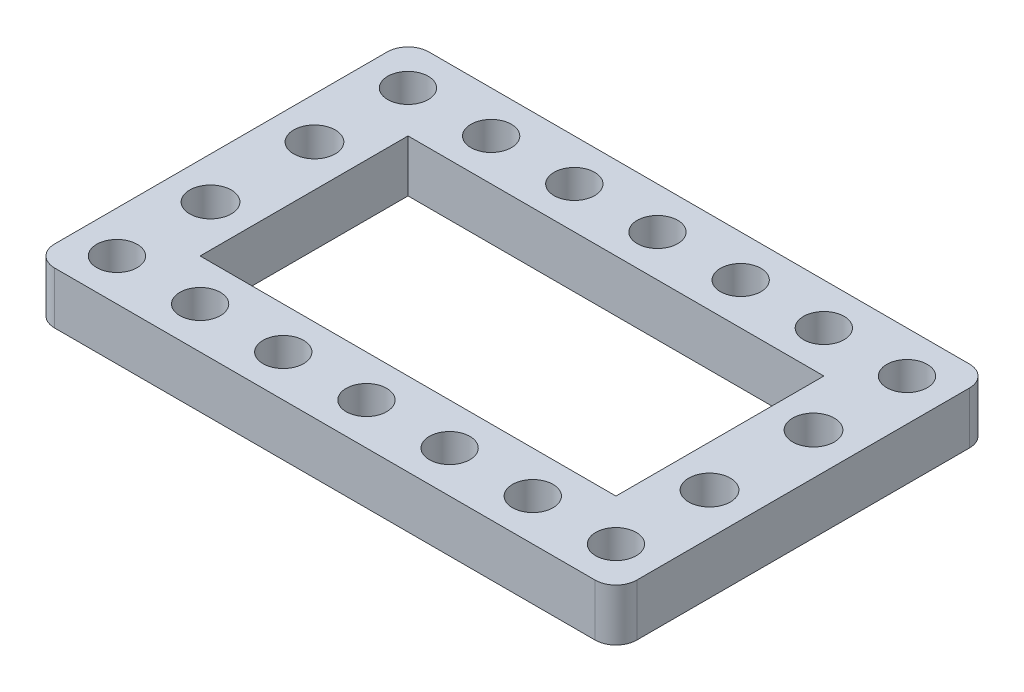
ISO-10303-21;
HEADER;
FILE_DESCRIPTION(('STEP AP214'),'2;1');
FILE_NAME('part.step','',(''),(''),'','','');
FILE_SCHEMA(('AUTOMOTIVE_DESIGN { 1 0 10303 214 1 1 1 1 }'));
ENDSEC;
DATA;
#1=APPLICATION_CONTEXT('core data for automotive mechanical design processes');
#2=APPLICATION_PROTOCOL_DEFINITION('international standard','automotive_design',2000,#1);
#3=PRODUCT_CONTEXT('',#1,'mechanical');
#4=PRODUCT('Part','Part','',(#3));
#5=PRODUCT_RELATED_PRODUCT_CATEGORY('part','',(#4));
#6=PRODUCT_DEFINITION_FORMATION('','',#4);
#7=PRODUCT_DEFINITION_CONTEXT('part definition',#1,'design');
#8=PRODUCT_DEFINITION('design','',#6,#7);
#9=PRODUCT_DEFINITION_SHAPE('','',#8);
#10=(LENGTH_UNIT() NAMED_UNIT(*) SI_UNIT(.MILLI.,.METRE.));
#11=(NAMED_UNIT(*) PLANE_ANGLE_UNIT() SI_UNIT($,.RADIAN.));
#12=(NAMED_UNIT(*) SI_UNIT($,.STERADIAN.) SOLID_ANGLE_UNIT());
#13=UNCERTAINTY_MEASURE_WITH_UNIT(LENGTH_MEASURE(1.E-05),#10,'distance_accuracy_value','');
#14=(GEOMETRIC_REPRESENTATION_CONTEXT(3) GLOBAL_UNCERTAINTY_ASSIGNED_CONTEXT((#13)) GLOBAL_UNIT_ASSIGNED_CONTEXT((#10,
#11,#12)) REPRESENTATION_CONTEXT('',''));
#15=CARTESIAN_POINT('',(0.,0.,0.));
#16=DIRECTION('',(0.,0.,1.));
#17=DIRECTION('',(1.,0.,0.));
#18=AXIS2_PLACEMENT_3D('',#15,#16,#17);
#19=CARTESIAN_POINT('',(76.,5.,2.));
#20=DIRECTION('',(0.,-1.,0.));
#21=DIRECTION('',(0.,0.,-1.));
#22=AXIS2_PLACEMENT_3D('',#19,#20,#21);
#23=CYLINDRICAL_SURFACE('',#22,2.);
#24=DIRECTION('',(0.,-1.,0.));
#25=VECTOR('',#24,1.);
#26=CARTESIAN_POINT('',(76.,5.,0.));
#27=LINE('',#26,#25);
#28=CARTESIAN_POINT('',(76.,5.,0.));
#29=VERTEX_POINT('',#28);
#30=CARTESIAN_POINT('',(76.,0.,0.));
#31=VERTEX_POINT('',#30);
#32=EDGE_CURVE('E291',#29,#31,#27,.T.);
#33=ORIENTED_EDGE('',*,*,#32,.F.);
#34=CARTESIAN_POINT('',(76.,5.,2.));
#35=DIRECTION('',(0.,1.,0.));
#36=DIRECTION('',(0.,0.,1.));
#37=AXIS2_PLACEMENT_3D('',#34,#35,#36);
#38=CIRCLE('',#37,2.);
#39=CARTESIAN_POINT('',(78.,5.,2.));
#40=VERTEX_POINT('',#39);
#41=EDGE_CURVE('E40',#40,#29,#38,.T.);
#42=ORIENTED_EDGE('',*,*,#41,.F.);
#43=DIRECTION('',(0.,-1.,0.));
#44=VECTOR('',#43,1.);
#45=CARTESIAN_POINT('',(78.,-5.,2.));
#46=LINE('',#45,#44);
#47=CARTESIAN_POINT('',(78.,0.,2.));
#48=VERTEX_POINT('',#47);
#49=EDGE_CURVE('E294',#48,#40,#46,.F.);
#50=ORIENTED_EDGE('',*,*,#49,.F.);
#51=CARTESIAN_POINT('',(76.,0.,2.));
#52=DIRECTION('',(0.,1.,0.));
#53=DIRECTION('',(0.,0.,1.));
#54=AXIS2_PLACEMENT_3D('',#51,#52,#53);
#55=CIRCLE('',#54,2.);
#56=EDGE_CURVE('E11',#31,#48,#55,.F.);
#57=ORIENTED_EDGE('',*,*,#56,.F.);
#58=EDGE_LOOP('',(#33,#42,#50,#57));
#59=FACE_BOUND('',#58,.T.);
#60=ADVANCED_FACE('F33',(#59),#23,.T.);
#61=CARTESIAN_POINT('',(76.,-5.,34.));
#62=DIRECTION('',(0.,-1.,0.));
#63=DIRECTION('',(0.,0.,-1.));
#64=AXIS2_PLACEMENT_3D('',#61,#62,#63);
#65=CYLINDRICAL_SURFACE('',#64,2.);
#66=DIRECTION('',(0.,-1.,0.));
#67=VECTOR('',#66,1.);
#68=CARTESIAN_POINT('',(78.,-5.,34.));
#69=LINE('',#68,#67);
#70=CARTESIAN_POINT('',(78.,5.,34.));
#71=VERTEX_POINT('',#70);
#72=CARTESIAN_POINT('',(78.,0.,34.));
#73=VERTEX_POINT('',#72);
#74=EDGE_CURVE('E280',#71,#73,#69,.T.);
#75=ORIENTED_EDGE('',*,*,#74,.F.);
#76=CARTESIAN_POINT('',(76.,5.,34.));
#77=DIRECTION('',(0.,1.,0.));
#78=DIRECTION('',(0.,0.,1.));
#79=AXIS2_PLACEMENT_3D('',#76,#77,#78);
#80=CIRCLE('',#79,2.);
#81=CARTESIAN_POINT('',(76.,5.,36.));
#82=VERTEX_POINT('',#81);
#83=EDGE_CURVE('E286',#82,#71,#80,.T.);
#84=ORIENTED_EDGE('',*,*,#83,.F.);
#85=DIRECTION('',(0.,-1.,0.));
#86=VECTOR('',#85,1.);
#87=CARTESIAN_POINT('',(76.,5.,36.));
#88=LINE('',#87,#86);
#89=CARTESIAN_POINT('',(76.,0.,36.));
#90=VERTEX_POINT('',#89);
#91=EDGE_CURVE('E283',#90,#82,#88,.F.);
#92=ORIENTED_EDGE('',*,*,#91,.F.);
#93=CARTESIAN_POINT('',(76.,0.,34.));
#94=DIRECTION('',(0.,1.,0.));
#95=DIRECTION('',(0.,0.,1.));
#96=AXIS2_PLACEMENT_3D('',#93,#94,#95);
#97=CIRCLE('',#96,2.);
#98=EDGE_CURVE('E289',#73,#90,#97,.F.);
#99=ORIENTED_EDGE('',*,*,#98,.F.);
#100=EDGE_LOOP('',(#75,#84,#92,#99));
#101=FACE_BOUND('',#100,.T.);
#102=ADVANCED_FACE('F351',(#101),#65,.T.);
#103=CARTESIAN_POINT('',(24.,-5.,34.));
#104=DIRECTION('',(0.,1.,0.));
#105=DIRECTION('',(0.,0.,1.));
#106=AXIS2_PLACEMENT_3D('',#103,#104,#105);
#107=CYLINDRICAL_SURFACE('',#106,2.);
#108=DIRECTION('',(0.,1.,0.));
#109=VECTOR('',#108,1.);
#110=CARTESIAN_POINT('',(22.,-5.,34.));
#111=LINE('',#110,#109);
#112=CARTESIAN_POINT('',(22.,0.,34.));
#113=VERTEX_POINT('',#112);
#114=CARTESIAN_POINT('',(22.,5.,34.));
#115=VERTEX_POINT('',#114);
#116=EDGE_CURVE('E270',#113,#115,#111,.T.);
#117=ORIENTED_EDGE('',*,*,#116,.F.);
#118=CARTESIAN_POINT('',(24.,0.,34.));
#119=DIRECTION('',(0.,1.,0.));
#120=DIRECTION('',(0.,0.,1.));
#121=AXIS2_PLACEMENT_3D('',#118,#119,#120);
#122=CIRCLE('',#121,2.);
#123=CARTESIAN_POINT('',(24.,0.,36.));
#124=VERTEX_POINT('',#123);
#125=EDGE_CURVE('E276',#124,#113,#122,.F.);
#126=ORIENTED_EDGE('',*,*,#125,.F.);
#127=DIRECTION('',(0.,1.,0.));
#128=VECTOR('',#127,1.);
#129=CARTESIAN_POINT('',(24.,5.,36.));
#130=LINE('',#129,#128);
#131=CARTESIAN_POINT('',(24.,5.,36.));
#132=VERTEX_POINT('',#131);
#133=EDGE_CURVE('E273',#132,#124,#130,.F.);
#134=ORIENTED_EDGE('',*,*,#133,.F.);
#135=CARTESIAN_POINT('',(24.,5.,34.));
#136=DIRECTION('',(0.,1.,0.));
#137=DIRECTION('',(0.,0.,1.));
#138=AXIS2_PLACEMENT_3D('',#135,#136,#137);
#139=CIRCLE('',#138,2.);
#140=EDGE_CURVE('E278',#115,#132,#139,.T.);
#141=ORIENTED_EDGE('',*,*,#140,.F.);
#142=EDGE_LOOP('',(#117,#126,#134,#141));
#143=FACE_BOUND('',#142,.T.);
#144=ADVANCED_FACE('F355',(#143),#107,.T.);
#145=CARTESIAN_POINT('',(24.,-5.,2.));
#146=DIRECTION('',(0.,-1.,0.));
#147=DIRECTION('',(0.,0.,-1.));
#148=AXIS2_PLACEMENT_3D('',#145,#146,#147);
#149=CYLINDRICAL_SURFACE('',#148,2.);
#150=DIRECTION('',(0.,-1.,0.));
#151=VECTOR('',#150,1.);
#152=CARTESIAN_POINT('',(22.,-5.,2.));
#153=LINE('',#152,#151);
#154=CARTESIAN_POINT('',(22.,5.,2.));
#155=VERTEX_POINT('',#154);
#156=CARTESIAN_POINT('',(22.,0.,1.99999999999999));
#157=VERTEX_POINT('',#156);
#158=EDGE_CURVE('E258',#155,#157,#153,.T.);
#159=ORIENTED_EDGE('',*,*,#158,.F.);
#160=CARTESIAN_POINT('',(24.,5.,2.));
#161=DIRECTION('',(0.,1.,0.));
#162=DIRECTION('',(0.,0.,1.));
#163=AXIS2_PLACEMENT_3D('',#160,#161,#162);
#164=CIRCLE('',#163,2.);
#165=CARTESIAN_POINT('',(24.,5.,0.));
#166=VERTEX_POINT('',#165);
#167=EDGE_CURVE('E264',#166,#155,#164,.T.);
#168=ORIENTED_EDGE('',*,*,#167,.F.);
#169=DIRECTION('',(0.,-1.,0.));
#170=VECTOR('',#169,1.);
#171=CARTESIAN_POINT('',(24.,5.,0.));
#172=LINE('',#171,#170);
#173=CARTESIAN_POINT('',(24.,0.,0.));
#174=VERTEX_POINT('',#173);
#175=EDGE_CURVE('E261',#174,#166,#172,.F.);
#176=ORIENTED_EDGE('',*,*,#175,.F.);
#177=CARTESIAN_POINT('',(24.,0.,2.));
#178=DIRECTION('',(0.,1.,0.));
#179=DIRECTION('',(0.,0.,1.));
#180=AXIS2_PLACEMENT_3D('',#177,#178,#179);
#181=CIRCLE('',#180,2.);
#182=EDGE_CURVE('E267',#157,#174,#181,.F.);
#183=ORIENTED_EDGE('',*,*,#182,.F.);
#184=EDGE_LOOP('',(#159,#168,#176,#183));
#185=FACE_BOUND('',#184,.T.);
#186=ADVANCED_FACE('F307',(#185),#149,.T.);
#187=CARTESIAN_POINT('',(2.00000000000001,5.,0.));
#188=DIRECTION('',(0.,0.,1.));
#189=DIRECTION('',(1.,0.,0.));
#190=AXIS2_PLACEMENT_3D('',#187,#188,#189);
#191=PLANE('',#190);
#192=DIRECTION('',(-1.,0.,0.));
#193=VECTOR('',#192,1.);
#194=CARTESIAN_POINT('',(2.00000000000001,5.,0.));
#195=LINE('',#194,#193);
#196=EDGE_CURVE('E245',#29,#166,#195,.T.);
#197=ORIENTED_EDGE('',*,*,#196,.F.);
#198=ORIENTED_EDGE('',*,*,#32,.T.);
#199=DIRECTION('',(-1.,0.,0.));
#200=VECTOR('',#199,1.);
#201=CARTESIAN_POINT('',(2.00000000000001,0.,0.));
#202=LINE('',#201,#200);
#203=EDGE_CURVE('E236',#31,#174,#202,.T.);
#204=ORIENTED_EDGE('',*,*,#203,.T.);
#205=ORIENTED_EDGE('',*,*,#175,.T.);
#206=EDGE_LOOP('',(#197,#198,#204,#205));
#207=FACE_BOUND('',#206,.T.);
#208=ADVANCED_FACE('F302',(#207),#191,.F.);
#209=CARTESIAN_POINT('',(2.,5.,36.));
#210=DIRECTION('',(0.,0.,-1.));
#211=DIRECTION('',(-1.,0.,0.));
#212=AXIS2_PLACEMENT_3D('',#209,#210,#211);
#213=PLANE('',#212);
#214=DIRECTION('',(1.,0.,0.));
#215=VECTOR('',#214,1.);
#216=CARTESIAN_POINT('',(2.,0.,36.));
#217=LINE('',#216,#215);
#218=EDGE_CURVE('E248',#124,#90,#217,.T.);
#219=ORIENTED_EDGE('',*,*,#218,.T.);
#220=ORIENTED_EDGE('',*,*,#91,.T.);
#221=DIRECTION('',(1.,0.,0.));
#222=VECTOR('',#221,1.);
#223=CARTESIAN_POINT('',(2.,5.,36.));
#224=LINE('',#223,#222);
#225=EDGE_CURVE('E247',#132,#82,#224,.T.);
#226=ORIENTED_EDGE('',*,*,#225,.F.);
#227=ORIENTED_EDGE('',*,*,#133,.T.);
#228=EDGE_LOOP('',(#219,#220,#226,#227));
#229=FACE_BOUND('',#228,.T.);
#230=ADVANCED_FACE('F328',(#229),#213,.F.);
#231=CARTESIAN_POINT('',(98.,5.,34.));
#232=DIRECTION('',(0.,1.,0.));
#233=DIRECTION('',(0.,0.,1.));
#234=AXIS2_PLACEMENT_3D('',#231,#232,#233);
#235=PLANE('',#234);
#236=CARTESIAN_POINT('',(74.,5.,23.));
#237=DIRECTION('',(0.,1.,0.));
#238=DIRECTION('',(0.,0.,1.));
#239=AXIS2_PLACEMENT_3D('',#236,#237,#238);
#240=CIRCLE('',#239,2.);
#241=CARTESIAN_POINT('',(74.,5.,25.));
#242=VERTEX_POINT('',#241);
#243=EDGE_CURVE('E619',#242,#242,#240,.T.);
#244=ORIENTED_EDGE('',*,*,#243,.F.);
#245=EDGE_LOOP('',(#244));
#246=FACE_BOUND('',#245,.T.);
#247=CARTESIAN_POINT('',(26.,5.,13.));
#248=DIRECTION('',(0.,1.,0.));
#249=DIRECTION('',(0.,0.,1.));
#250=AXIS2_PLACEMENT_3D('',#247,#248,#249);
#251=CIRCLE('',#250,2.);
#252=CARTESIAN_POINT('',(26.,5.,15.));
#253=VERTEX_POINT('',#252);
#254=EDGE_CURVE('E624',#253,#253,#251,.T.);
#255=ORIENTED_EDGE('',*,*,#254,.F.);
#256=EDGE_LOOP('',(#255));
#257=FACE_BOUND('',#256,.T.);
#258=CARTESIAN_POINT('',(26.,5.,23.));
#259=DIRECTION('',(0.,1.,0.));
#260=DIRECTION('',(0.,0.,1.));
#261=AXIS2_PLACEMENT_3D('',#258,#259,#260);
#262=CIRCLE('',#261,2.00000000000001);
#263=CARTESIAN_POINT('',(26.,5.,25.));
#264=VERTEX_POINT('',#263);
#265=EDGE_CURVE('E637',#264,#264,#262,.T.);
#266=ORIENTED_EDGE('',*,*,#265,.F.);
#267=EDGE_LOOP('',(#266));
#268=FACE_BOUND('',#267,.T.);
#269=CARTESIAN_POINT('',(74.,5.,13.));
#270=DIRECTION('',(0.,1.,0.));
#271=DIRECTION('',(0.,0.,1.));
#272=AXIS2_PLACEMENT_3D('',#269,#270,#271);
#273=CIRCLE('',#272,2.);
#274=CARTESIAN_POINT('',(74.,5.,15.));
#275=VERTEX_POINT('',#274);
#276=EDGE_CURVE('E316',#275,#275,#273,.T.);
#277=ORIENTED_EDGE('',*,*,#276,.F.);
#278=EDGE_LOOP('',(#277));
#279=FACE_BOUND('',#278,.T.);
#280=DIRECTION('',(0.,0.,1.));
#281=VECTOR('',#280,1.);
#282=CARTESIAN_POINT('',(78.,5.,0.));
#283=LINE('',#282,#281);
#284=EDGE_CURVE('E156',#40,#71,#283,.T.);
#285=ORIENTED_EDGE('',*,*,#284,.F.);
#286=ORIENTED_EDGE('',*,*,#41,.T.);
#287=ORIENTED_EDGE('',*,*,#196,.T.);
#288=ORIENTED_EDGE('',*,*,#167,.T.);
#289=DIRECTION('',(0.,0.,-1.));
#290=VECTOR('',#289,1.);
#291=CARTESIAN_POINT('',(22.,5.,0.));
#292=LINE('',#291,#290);
#293=EDGE_CURVE('E309',#115,#155,#292,.T.);
#294=ORIENTED_EDGE('',*,*,#293,.F.);
#295=ORIENTED_EDGE('',*,*,#140,.T.);
#296=ORIENTED_EDGE('',*,*,#225,.T.);
#297=ORIENTED_EDGE('',*,*,#83,.T.);
#298=EDGE_LOOP('',(#285,#286,#287,#288,#294,#295,#296,#297));
#299=FACE_BOUND('',#298,.T.);
#300=CARTESIAN_POINT('',(74.,5.,4.00475022032541));
#301=DIRECTION('',(0.,1.,0.));
#302=DIRECTION('',(0.,0.,1.));
#303=AXIS2_PLACEMENT_3D('',#300,#301,#302);
#304=CIRCLE('',#303,1.95);
#305=CARTESIAN_POINT('',(74.,5.,5.95475022032541));
#306=VERTEX_POINT('',#305);
#307=EDGE_CURVE('E182',#306,#306,#304,.T.);
#308=ORIENTED_EDGE('',*,*,#307,.F.);
#309=EDGE_LOOP('',(#308));
#310=FACE_BOUND('',#309,.T.);
#311=CARTESIAN_POINT('',(26.,5.,32.));
#312=DIRECTION('',(0.,1.,0.));
#313=DIRECTION('',(0.,0.,1.));
#314=AXIS2_PLACEMENT_3D('',#311,#312,#313);
#315=CIRCLE('',#314,1.95);
#316=CARTESIAN_POINT('',(26.,5.,33.95));
#317=VERTEX_POINT('',#316);
#318=EDGE_CURVE('E183',#317,#317,#315,.T.);
#319=ORIENTED_EDGE('',*,*,#318,.F.);
#320=EDGE_LOOP('',(#319));
#321=FACE_BOUND('',#320,.T.);
#322=CARTESIAN_POINT('',(34.,5.,32.));
#323=DIRECTION('',(0.,1.,0.));
#324=DIRECTION('',(0.,0.,1.));
#325=AXIS2_PLACEMENT_3D('',#322,#323,#324);
#326=CIRCLE('',#325,1.94999999999999);
#327=CARTESIAN_POINT('',(34.,5.,33.95));
#328=VERTEX_POINT('',#327);
#329=EDGE_CURVE('E189',#328,#328,#326,.T.);
#330=ORIENTED_EDGE('',*,*,#329,.F.);
#331=EDGE_LOOP('',(#330));
#332=FACE_BOUND('',#331,.T.);
#333=CARTESIAN_POINT('',(42.,5.,32.));
#334=DIRECTION('',(0.,1.,0.));
#335=DIRECTION('',(0.,0.,1.));
#336=AXIS2_PLACEMENT_3D('',#333,#334,#335);
#337=CIRCLE('',#336,1.95000000000001);
#338=CARTESIAN_POINT('',(42.,5.,33.95));
#339=VERTEX_POINT('',#338);
#340=EDGE_CURVE('E195',#339,#339,#337,.T.);
#341=ORIENTED_EDGE('',*,*,#340,.F.);
#342=EDGE_LOOP('',(#341));
#343=FACE_BOUND('',#342,.T.);
#344=CARTESIAN_POINT('',(50.,5.,32.));
#345=DIRECTION('',(0.,1.,0.));
#346=DIRECTION('',(0.,0.,1.));
#347=AXIS2_PLACEMENT_3D('',#344,#345,#346);
#348=CIRCLE('',#347,1.95);
#349=CARTESIAN_POINT('',(50.,5.,33.95));
#350=VERTEX_POINT('',#349);
#351=EDGE_CURVE('E168',#350,#350,#348,.T.);
#352=ORIENTED_EDGE('',*,*,#351,.F.);
#353=EDGE_LOOP('',(#352));
#354=FACE_BOUND('',#353,.T.);
#355=CARTESIAN_POINT('',(34.,5.,4.00475022032542));
#356=DIRECTION('',(0.,1.,0.));
#357=DIRECTION('',(0.,0.,1.));
#358=AXIS2_PLACEMENT_3D('',#355,#356,#357);
#359=CIRCLE('',#358,1.95);
#360=CARTESIAN_POINT('',(34.,5.,5.95475022032542));
#361=VERTEX_POINT('',#360);
#362=EDGE_CURVE('E212',#361,#361,#359,.T.);
#363=ORIENTED_EDGE('',*,*,#362,.F.);
#364=EDGE_LOOP('',(#363));
#365=FACE_BOUND('',#364,.T.);
#366=CARTESIAN_POINT('',(26.,5.,4.00475022032542));
#367=DIRECTION('',(0.,1.,0.));
#368=DIRECTION('',(0.,0.,1.));
#369=AXIS2_PLACEMENT_3D('',#366,#367,#368);
#370=CIRCLE('',#369,1.95);
#371=CARTESIAN_POINT('',(26.,5.,5.95475022032542));
#372=VERTEX_POINT('',#371);
#373=EDGE_CURVE('E237',#372,#372,#370,.T.);
#374=ORIENTED_EDGE('',*,*,#373,.F.);
#375=EDGE_LOOP('',(#374));
#376=FACE_BOUND('',#375,.T.);
#377=CARTESIAN_POINT('',(42.,5.,4.00475022032542));
#378=DIRECTION('',(0.,1.,0.));
#379=DIRECTION('',(0.,0.,1.));
#380=AXIS2_PLACEMENT_3D('',#377,#378,#379);
#381=CIRCLE('',#380,1.95000000000001);
#382=CARTESIAN_POINT('',(42.,5.,5.95475022032542));
#383=VERTEX_POINT('',#382);
#384=EDGE_CURVE('E213',#383,#383,#381,.T.);
#385=ORIENTED_EDGE('',*,*,#384,.F.);
#386=EDGE_LOOP('',(#385));
#387=FACE_BOUND('',#386,.T.);
#388=CARTESIAN_POINT('',(50.,5.,4.00475022032542));
#389=DIRECTION('',(0.,1.,0.));
#390=DIRECTION('',(0.,0.,1.));
#391=AXIS2_PLACEMENT_3D('',#388,#389,#390);
#392=CIRCLE('',#391,1.95);
#393=CARTESIAN_POINT('',(50.,5.,5.95475022032542));
#394=VERTEX_POINT('',#393);
#395=EDGE_CURVE('E219',#394,#394,#392,.T.);
#396=ORIENTED_EDGE('',*,*,#395,.F.);
#397=EDGE_LOOP('',(#396));
#398=FACE_BOUND('',#397,.T.);
#399=CARTESIAN_POINT('',(58.,5.,4.00475022032542));
#400=DIRECTION('',(0.,1.,0.));
#401=DIRECTION('',(0.,0.,1.));
#402=AXIS2_PLACEMENT_3D('',#399,#400,#401);
#403=CIRCLE('',#402,1.95);
#404=CARTESIAN_POINT('',(58.,5.,5.95475022032541));
#405=VERTEX_POINT('',#404);
#406=EDGE_CURVE('E225',#405,#405,#403,.T.);
#407=ORIENTED_EDGE('',*,*,#406,.F.);
#408=EDGE_LOOP('',(#407));
#409=FACE_BOUND('',#408,.T.);
#410=CARTESIAN_POINT('',(66.,5.,4.00475022032541));
#411=DIRECTION('',(0.,1.,0.));
#412=DIRECTION('',(0.,0.,1.));
#413=AXIS2_PLACEMENT_3D('',#410,#411,#412);
#414=CIRCLE('',#413,1.95);
#415=CARTESIAN_POINT('',(66.,5.,5.95475022032541));
#416=VERTEX_POINT('',#415);
#417=EDGE_CURVE('E206',#416,#416,#414,.T.);
#418=ORIENTED_EDGE('',*,*,#417,.F.);
#419=EDGE_LOOP('',(#418));
#420=FACE_BOUND('',#419,.T.);
#421=DIRECTION('',(0.,0.,1.));
#422=VECTOR('',#421,1.);
#423=CARTESIAN_POINT('',(30.,5.,8.00000000000001));
#424=LINE('',#423,#422);
#425=CARTESIAN_POINT('',(30.,5.,8.00000000000001));
#426=VERTEX_POINT('',#425);
#427=CARTESIAN_POINT('',(30.,5.,28.));
#428=VERTEX_POINT('',#427);
#429=EDGE_CURVE('E125',#426,#428,#424,.T.);
#430=ORIENTED_EDGE('',*,*,#429,.F.);
#431=DIRECTION('',(-1.,0.,0.));
#432=VECTOR('',#431,1.);
#433=CARTESIAN_POINT('',(30.,5.,8.00000000000001));
#434=LINE('',#433,#432);
#435=CARTESIAN_POINT('',(70.,5.,8.));
#436=VERTEX_POINT('',#435);
#437=EDGE_CURVE('E143',#436,#426,#434,.T.);
#438=ORIENTED_EDGE('',*,*,#437,.F.);
#439=DIRECTION('',(0.,0.,-1.));
#440=VECTOR('',#439,1.);
#441=CARTESIAN_POINT('',(70.,5.,8.));
#442=LINE('',#441,#440);
#443=CARTESIAN_POINT('',(70.,5.,28.));
#444=VERTEX_POINT('',#443);
#445=EDGE_CURVE('E146',#444,#436,#442,.T.);
#446=ORIENTED_EDGE('',*,*,#445,.F.);
#447=DIRECTION('',(1.,0.,0.));
#448=VECTOR('',#447,1.);
#449=CARTESIAN_POINT('',(30.,5.,28.));
#450=LINE('',#449,#448);
#451=EDGE_CURVE('E155',#428,#444,#450,.T.);
#452=ORIENTED_EDGE('',*,*,#451,.F.);
#453=EDGE_LOOP('',(#430,#438,#446,#452));
#454=FACE_BOUND('',#453,.T.);
#455=CARTESIAN_POINT('',(74.,5.,32.));
#456=DIRECTION('',(0.,1.,0.));
#457=DIRECTION('',(0.,0.,1.));
#458=AXIS2_PLACEMENT_3D('',#455,#456,#457);
#459=CIRCLE('',#458,1.95);
#460=CARTESIAN_POINT('',(74.,5.,33.95));
#461=VERTEX_POINT('',#460);
#462=EDGE_CURVE('E149',#461,#461,#459,.T.);
#463=ORIENTED_EDGE('',*,*,#462,.F.);
#464=EDGE_LOOP('',(#463));
#465=FACE_BOUND('',#464,.T.);
#466=CARTESIAN_POINT('',(66.,5.,32.));
#467=DIRECTION('',(0.,1.,0.));
#468=DIRECTION('',(0.,0.,1.));
#469=AXIS2_PLACEMENT_3D('',#466,#467,#468);
#470=CIRCLE('',#469,1.95);
#471=CARTESIAN_POINT('',(66.,5.,33.95));
#472=VERTEX_POINT('',#471);
#473=EDGE_CURVE('E175',#472,#472,#470,.T.);
#474=ORIENTED_EDGE('',*,*,#473,.F.);
#475=EDGE_LOOP('',(#474));
#476=FACE_BOUND('',#475,.T.);
#477=CARTESIAN_POINT('',(58.,5.,32.));
#478=DIRECTION('',(0.,1.,0.));
#479=DIRECTION('',(0.,0.,1.));
#480=AXIS2_PLACEMENT_3D('',#477,#478,#479);
#481=CIRCLE('',#480,1.95);
#482=CARTESIAN_POINT('',(58.,5.,33.95));
#483=VERTEX_POINT('',#482);
#484=EDGE_CURVE('E169',#483,#483,#481,.T.);
#485=ORIENTED_EDGE('',*,*,#484,.F.);
#486=EDGE_LOOP('',(#485));
#487=FACE_BOUND('',#486,.T.);
#488=ADVANCED_FACE('F297',(#246,#257,#268,#279,#299,#310,#321,#332,#343,#354,#365,#376,#387,
#398,#409,#420,#454,#465,#476,#487),#235,.T.);
#489=CARTESIAN_POINT('',(98.,0.,34.));
#490=DIRECTION('',(0.,1.,0.));
#491=DIRECTION('',(0.,0.,1.));
#492=AXIS2_PLACEMENT_3D('',#489,#490,#491);
#493=PLANE('',#492);
#494=CARTESIAN_POINT('',(74.,0.,23.));
#495=DIRECTION('',(0.,1.,0.));
#496=DIRECTION('',(0.,0.,1.));
#497=AXIS2_PLACEMENT_3D('',#494,#495,#496);
#498=CIRCLE('',#497,2.);
#499=CARTESIAN_POINT('',(74.,0.,25.));
#500=VERTEX_POINT('',#499);
#501=EDGE_CURVE('E616',#500,#500,#498,.T.);
#502=ORIENTED_EDGE('',*,*,#501,.T.);
#503=EDGE_LOOP('',(#502));
#504=FACE_BOUND('',#503,.T.);
#505=CARTESIAN_POINT('',(26.,0.,13.));
#506=DIRECTION('',(0.,1.,0.));
#507=DIRECTION('',(0.,0.,1.));
#508=AXIS2_PLACEMENT_3D('',#505,#506,#507);
#509=CIRCLE('',#508,2.);
#510=CARTESIAN_POINT('',(26.,0.,15.));
#511=VERTEX_POINT('',#510);
#512=EDGE_CURVE('E620',#511,#511,#509,.T.);
#513=ORIENTED_EDGE('',*,*,#512,.T.);
#514=EDGE_LOOP('',(#513));
#515=FACE_BOUND('',#514,.T.);
#516=CARTESIAN_POINT('',(26.,0.,23.));
#517=DIRECTION('',(0.,1.,0.));
#518=DIRECTION('',(0.,0.,1.));
#519=AXIS2_PLACEMENT_3D('',#516,#517,#518);
#520=CIRCLE('',#519,2.00000000000001);
#521=CARTESIAN_POINT('',(26.,0.,25.));
#522=VERTEX_POINT('',#521);
#523=EDGE_CURVE('E629',#522,#522,#520,.T.);
#524=ORIENTED_EDGE('',*,*,#523,.T.);
#525=EDGE_LOOP('',(#524));
#526=FACE_BOUND('',#525,.T.);
#527=CARTESIAN_POINT('',(74.,0.,13.));
#528=DIRECTION('',(0.,1.,0.));
#529=DIRECTION('',(0.,0.,1.));
#530=AXIS2_PLACEMENT_3D('',#527,#528,#529);
#531=CIRCLE('',#530,2.);
#532=CARTESIAN_POINT('',(74.,0.,15.));
#533=VERTEX_POINT('',#532);
#534=EDGE_CURVE('E312',#533,#533,#531,.T.);
#535=ORIENTED_EDGE('',*,*,#534,.T.);
#536=EDGE_LOOP('',(#535));
#537=FACE_BOUND('',#536,.T.);
#538=CARTESIAN_POINT('',(74.,0.,4.00475022032541));
#539=DIRECTION('',(0.,1.,0.));
#540=DIRECTION('',(0.,0.,1.));
#541=AXIS2_PLACEMENT_3D('',#538,#539,#540);
#542=CIRCLE('',#541,1.95);
#543=CARTESIAN_POINT('',(74.,0.,5.95475022032541));
#544=VERTEX_POINT('',#543);
#545=EDGE_CURVE('E203',#544,#544,#542,.T.);
#546=ORIENTED_EDGE('',*,*,#545,.T.);
#547=EDGE_LOOP('',(#546));
#548=FACE_BOUND('',#547,.T.);
#549=CARTESIAN_POINT('',(26.,0.,32.));
#550=DIRECTION('',(0.,1.,0.));
#551=DIRECTION('',(0.,0.,1.));
#552=AXIS2_PLACEMENT_3D('',#549,#550,#551);
#553=CIRCLE('',#552,1.95);
#554=CARTESIAN_POINT('',(26.,0.,33.95));
#555=VERTEX_POINT('',#554);
#556=EDGE_CURVE('E179',#555,#555,#553,.T.);
#557=ORIENTED_EDGE('',*,*,#556,.T.);
#558=EDGE_LOOP('',(#557));
#559=FACE_BOUND('',#558,.T.);
#560=CARTESIAN_POINT('',(34.,0.,32.));
#561=DIRECTION('',(0.,1.,0.));
#562=DIRECTION('',(0.,0.,1.));
#563=AXIS2_PLACEMENT_3D('',#560,#561,#562);
#564=CIRCLE('',#563,1.94999999999999);
#565=CARTESIAN_POINT('',(34.,0.,33.95));
#566=VERTEX_POINT('',#565);
#567=EDGE_CURVE('E186',#566,#566,#564,.T.);
#568=ORIENTED_EDGE('',*,*,#567,.T.);
#569=EDGE_LOOP('',(#568));
#570=FACE_BOUND('',#569,.T.);
#571=CARTESIAN_POINT('',(42.,0.,32.));
#572=DIRECTION('',(0.,1.,0.));
#573=DIRECTION('',(0.,0.,1.));
#574=AXIS2_PLACEMENT_3D('',#571,#572,#573);
#575=CIRCLE('',#574,1.95000000000001);
#576=CARTESIAN_POINT('',(42.,0.,33.95));
#577=VERTEX_POINT('',#576);
#578=EDGE_CURVE('E192',#577,#577,#575,.T.);
#579=ORIENTED_EDGE('',*,*,#578,.T.);
#580=EDGE_LOOP('',(#579));
#581=FACE_BOUND('',#580,.T.);
#582=CARTESIAN_POINT('',(50.,0.,32.));
#583=DIRECTION('',(0.,1.,0.));
#584=DIRECTION('',(0.,0.,1.));
#585=AXIS2_PLACEMENT_3D('',#582,#583,#584);
#586=CIRCLE('',#585,1.95);
#587=CARTESIAN_POINT('',(50.,0.,33.95));
#588=VERTEX_POINT('',#587);
#589=EDGE_CURVE('E198',#588,#588,#586,.T.);
#590=ORIENTED_EDGE('',*,*,#589,.T.);
#591=EDGE_LOOP('',(#590));
#592=FACE_BOUND('',#591,.T.);
#593=CARTESIAN_POINT('',(34.,0.,4.00475022032542));
#594=DIRECTION('',(0.,1.,0.));
#595=DIRECTION('',(0.,0.,1.));
#596=AXIS2_PLACEMENT_3D('',#593,#594,#595);
#597=CIRCLE('',#596,1.95);
#598=CARTESIAN_POINT('',(34.,0.,5.95475022032542));
#599=VERTEX_POINT('',#598);
#600=EDGE_CURVE('E240',#599,#599,#597,.T.);
#601=ORIENTED_EDGE('',*,*,#600,.T.);
#602=EDGE_LOOP('',(#601));
#603=FACE_BOUND('',#602,.T.);
#604=CARTESIAN_POINT('',(26.,0.,4.00475022032542));
#605=DIRECTION('',(0.,1.,0.));
#606=DIRECTION('',(0.,0.,1.));
#607=AXIS2_PLACEMENT_3D('',#604,#605,#606);
#608=CIRCLE('',#607,1.95);
#609=CARTESIAN_POINT('',(26.,0.,5.95475022032542));
#610=VERTEX_POINT('',#609);
#611=EDGE_CURVE('E233',#610,#610,#608,.T.);
#612=ORIENTED_EDGE('',*,*,#611,.T.);
#613=EDGE_LOOP('',(#612));
#614=FACE_BOUND('',#613,.T.);
#615=CARTESIAN_POINT('',(42.,0.,4.00475022032542));
#616=DIRECTION('',(0.,1.,0.));
#617=DIRECTION('',(0.,0.,1.));
#618=AXIS2_PLACEMENT_3D('',#615,#616,#617);
#619=CIRCLE('',#618,1.95000000000001);
#620=CARTESIAN_POINT('',(42.,0.,5.95475022032542));
#621=VERTEX_POINT('',#620);
#622=EDGE_CURVE('E209',#621,#621,#619,.T.);
#623=ORIENTED_EDGE('',*,*,#622,.T.);
#624=EDGE_LOOP('',(#623));
#625=FACE_BOUND('',#624,.T.);
#626=CARTESIAN_POINT('',(50.,0.,4.00475022032542));
#627=DIRECTION('',(0.,1.,0.));
#628=DIRECTION('',(0.,0.,1.));
#629=AXIS2_PLACEMENT_3D('',#626,#627,#628);
#630=CIRCLE('',#629,1.95);
#631=CARTESIAN_POINT('',(50.,0.,5.95475022032542));
#632=VERTEX_POINT('',#631);
#633=EDGE_CURVE('E216',#632,#632,#630,.T.);
#634=ORIENTED_EDGE('',*,*,#633,.T.);
#635=EDGE_LOOP('',(#634));
#636=FACE_BOUND('',#635,.T.);
#637=CARTESIAN_POINT('',(58.,0.,4.00475022032542));
#638=DIRECTION('',(0.,1.,0.));
#639=DIRECTION('',(0.,0.,1.));
#640=AXIS2_PLACEMENT_3D('',#637,#638,#639);
#641=CIRCLE('',#640,1.95);
#642=CARTESIAN_POINT('',(58.,0.,5.95475022032541));
#643=VERTEX_POINT('',#642);
#644=EDGE_CURVE('E222',#643,#643,#641,.T.);
#645=ORIENTED_EDGE('',*,*,#644,.T.);
#646=EDGE_LOOP('',(#645));
#647=FACE_BOUND('',#646,.T.);
#648=CARTESIAN_POINT('',(66.,0.,4.00475022032541));
#649=DIRECTION('',(0.,1.,0.));
#650=DIRECTION('',(0.,0.,1.));
#651=AXIS2_PLACEMENT_3D('',#648,#649,#650);
#652=CIRCLE('',#651,1.95);
#653=CARTESIAN_POINT('',(66.,0.,5.95475022032541));
#654=VERTEX_POINT('',#653);
#655=EDGE_CURVE('E228',#654,#654,#652,.T.);
#656=ORIENTED_EDGE('',*,*,#655,.T.);
#657=EDGE_LOOP('',(#656));
#658=FACE_BOUND('',#657,.T.);
#659=DIRECTION('',(-1.,0.,0.));
#660=VECTOR('',#659,1.);
#661=CARTESIAN_POINT('',(30.,0.,8.00000000000001));
#662=LINE('',#661,#660);
#663=CARTESIAN_POINT('',(70.,0.,8.));
#664=VERTEX_POINT('',#663);
#665=CARTESIAN_POINT('',(30.,0.,8.00000000000001));
#666=VERTEX_POINT('',#665);
#667=EDGE_CURVE('E130',#664,#666,#662,.T.);
#668=ORIENTED_EDGE('',*,*,#667,.T.);
#669=DIRECTION('',(0.,0.,1.));
#670=VECTOR('',#669,1.);
#671=CARTESIAN_POINT('',(30.,0.,8.00000000000001));
#672=LINE('',#671,#670);
#673=CARTESIAN_POINT('',(30.,0.,28.));
#674=VERTEX_POINT('',#673);
#675=EDGE_CURVE('E122',#666,#674,#672,.T.);
#676=ORIENTED_EDGE('',*,*,#675,.T.);
#677=DIRECTION('',(1.,0.,0.));
#678=VECTOR('',#677,1.);
#679=CARTESIAN_POINT('',(30.,0.,28.));
#680=LINE('',#679,#678);
#681=CARTESIAN_POINT('',(70.,0.,28.));
#682=VERTEX_POINT('',#681);
#683=EDGE_CURVE('E134',#674,#682,#680,.T.);
#684=ORIENTED_EDGE('',*,*,#683,.T.);
#685=DIRECTION('',(0.,0.,-1.));
#686=VECTOR('',#685,1.);
#687=CARTESIAN_POINT('',(70.,0.,8.));
#688=LINE('',#687,#686);
#689=EDGE_CURVE('E138',#682,#664,#688,.T.);
#690=ORIENTED_EDGE('',*,*,#689,.T.);
#691=EDGE_LOOP('',(#668,#676,#684,#690));
#692=FACE_BOUND('',#691,.T.);
#693=CARTESIAN_POINT('',(74.,0.,32.));
#694=DIRECTION('',(0.,1.,0.));
#695=DIRECTION('',(0.,0.,1.));
#696=AXIS2_PLACEMENT_3D('',#693,#694,#695);
#697=CIRCLE('',#696,1.95);
#698=CARTESIAN_POINT('',(74.,0.,33.95));
#699=VERTEX_POINT('',#698);
#700=EDGE_CURVE('E178',#699,#699,#697,.T.);
#701=ORIENTED_EDGE('',*,*,#700,.T.);
#702=EDGE_LOOP('',(#701));
#703=FACE_BOUND('',#702,.T.);
#704=CARTESIAN_POINT('',(66.,0.,32.));
#705=DIRECTION('',(0.,1.,0.));
#706=DIRECTION('',(0.,0.,1.));
#707=AXIS2_PLACEMENT_3D('',#704,#705,#706);
#708=CIRCLE('',#707,1.95);
#709=CARTESIAN_POINT('',(66.,0.,33.95));
#710=VERTEX_POINT('',#709);
#711=EDGE_CURVE('E172',#710,#710,#708,.T.);
#712=ORIENTED_EDGE('',*,*,#711,.T.);
#713=EDGE_LOOP('',(#712));
#714=FACE_BOUND('',#713,.T.);
#715=CARTESIAN_POINT('',(58.,0.,32.));
#716=DIRECTION('',(0.,1.,0.));
#717=DIRECTION('',(0.,0.,1.));
#718=AXIS2_PLACEMENT_3D('',#715,#716,#717);
#719=CIRCLE('',#718,1.95);
#720=CARTESIAN_POINT('',(58.,0.,33.95));
#721=VERTEX_POINT('',#720);
#722=EDGE_CURVE('E165',#721,#721,#719,.T.);
#723=ORIENTED_EDGE('',*,*,#722,.T.);
#724=EDGE_LOOP('',(#723));
#725=FACE_BOUND('',#724,.T.);
#726=ORIENTED_EDGE('',*,*,#203,.F.);
#727=ORIENTED_EDGE('',*,*,#56,.T.);
#728=DIRECTION('',(0.,0.,1.));
#729=VECTOR('',#728,1.);
#730=CARTESIAN_POINT('',(78.,0.,34.));
#731=LINE('',#730,#729);
#732=EDGE_CURVE('E256',#48,#73,#731,.T.);
#733=ORIENTED_EDGE('',*,*,#732,.T.);
#734=ORIENTED_EDGE('',*,*,#98,.T.);
#735=ORIENTED_EDGE('',*,*,#218,.F.);
#736=ORIENTED_EDGE('',*,*,#125,.T.);
#737=DIRECTION('',(0.,0.,-1.));
#738=VECTOR('',#737,1.);
#739=CARTESIAN_POINT('',(22.,0.,34.));
#740=LINE('',#739,#738);
#741=EDGE_CURVE('E251',#113,#157,#740,.T.);
#742=ORIENTED_EDGE('',*,*,#741,.T.);
#743=ORIENTED_EDGE('',*,*,#182,.T.);
#744=EDGE_LOOP('',(#726,#727,#733,#734,#735,#736,#742,#743));
#745=FACE_BOUND('',#744,.T.);
#746=ADVANCED_FACE('F140',(#504,#515,#526,#537,#548,#559,#570,#581,#592,#603,#614,#625,#636,
#647,#658,#692,#703,#714,#725,#745),#493,.F.);
#747=CARTESIAN_POINT('',(58.,0.,32.));
#748=DIRECTION('',(0.,1.,0.));
#749=DIRECTION('',(0.,0.,1.));
#750=AXIS2_PLACEMENT_3D('',#747,#748,#749);
#751=CYLINDRICAL_SURFACE('',#750,1.95);
#752=ORIENTED_EDGE('',*,*,#722,.F.);
#753=EDGE_LOOP('',(#752));
#754=FACE_BOUND('',#753,.T.);
#755=ORIENTED_EDGE('',*,*,#484,.T.);
#756=EDGE_LOOP('',(#755));
#757=FACE_BOUND('',#756,.T.);
#758=ADVANCED_FACE('F335',(#754,#757),#751,.F.);
#759=CARTESIAN_POINT('',(66.,0.,32.));
#760=DIRECTION('',(0.,1.,0.));
#761=DIRECTION('',(0.,0.,1.));
#762=AXIS2_PLACEMENT_3D('',#759,#760,#761);
#763=CYLINDRICAL_SURFACE('',#762,1.95);
#764=ORIENTED_EDGE('',*,*,#711,.F.);
#765=EDGE_LOOP('',(#764));
#766=FACE_BOUND('',#765,.T.);
#767=ORIENTED_EDGE('',*,*,#473,.T.);
#768=EDGE_LOOP('',(#767));
#769=FACE_BOUND('',#768,.T.);
#770=ADVANCED_FACE('F337',(#766,#769),#763,.F.);
#771=CARTESIAN_POINT('',(74.,0.,32.));
#772=DIRECTION('',(0.,1.,0.));
#773=DIRECTION('',(0.,0.,1.));
#774=AXIS2_PLACEMENT_3D('',#771,#772,#773);
#775=CYLINDRICAL_SURFACE('',#774,1.95);
#776=ORIENTED_EDGE('',*,*,#700,.F.);
#777=EDGE_LOOP('',(#776));
#778=FACE_BOUND('',#777,.T.);
#779=ORIENTED_EDGE('',*,*,#462,.T.);
#780=EDGE_LOOP('',(#779));
#781=FACE_BOUND('',#780,.T.);
#782=ADVANCED_FACE('F324',(#778,#781),#775,.F.);
#783=CARTESIAN_POINT('',(30.,0.,8.00000000000001));
#784=DIRECTION('',(-1.,0.,0.));
#785=DIRECTION('',(0.,0.,1.));
#786=AXIS2_PLACEMENT_3D('',#783,#784,#785);
#787=PLANE('',#786);
#788=ORIENTED_EDGE('',*,*,#429,.T.);
#789=DIRECTION('',(0.,1.,0.));
#790=VECTOR('',#789,1.);
#791=CARTESIAN_POINT('',(30.,0.,28.));
#792=LINE('',#791,#790);
#793=EDGE_CURVE('E118',#674,#428,#792,.T.);
#794=ORIENTED_EDGE('',*,*,#793,.F.);
#795=ORIENTED_EDGE('',*,*,#675,.F.);
#796=DIRECTION('',(0.,1.,0.));
#797=VECTOR('',#796,1.);
#798=CARTESIAN_POINT('',(30.,0.,8.00000000000001));
#799=LINE('',#798,#797);
#800=EDGE_CURVE('E160',#666,#426,#799,.T.);
#801=ORIENTED_EDGE('',*,*,#800,.T.);
#802=EDGE_LOOP('',(#788,#794,#795,#801));
#803=FACE_BOUND('',#802,.T.);
#804=ADVANCED_FACE('F120',(#803),#787,.F.);
#805=CARTESIAN_POINT('',(30.,0.,8.00000000000001));
#806=DIRECTION('',(0.,0.,-1.));
#807=DIRECTION('',(-1.,0.,0.));
#808=AXIS2_PLACEMENT_3D('',#805,#806,#807);
#809=PLANE('',#808);
#810=ORIENTED_EDGE('',*,*,#437,.T.);
#811=ORIENTED_EDGE('',*,*,#800,.F.);
#812=ORIENTED_EDGE('',*,*,#667,.F.);
#813=DIRECTION('',(0.,1.,0.));
#814=VECTOR('',#813,1.);
#815=CARTESIAN_POINT('',(70.,0.,8.));
#816=LINE('',#815,#814);
#817=EDGE_CURVE('E162',#664,#436,#816,.T.);
#818=ORIENTED_EDGE('',*,*,#817,.T.);
#819=EDGE_LOOP('',(#810,#811,#812,#818));
#820=FACE_BOUND('',#819,.T.);
#821=ADVANCED_FACE('F445',(#820),#809,.F.);
#822=CARTESIAN_POINT('',(70.,0.,8.));
#823=DIRECTION('',(1.,0.,0.));
#824=DIRECTION('',(0.,0.,-1.));
#825=AXIS2_PLACEMENT_3D('',#822,#823,#824);
#826=PLANE('',#825);
#827=ORIENTED_EDGE('',*,*,#445,.T.);
#828=ORIENTED_EDGE('',*,*,#817,.F.);
#829=ORIENTED_EDGE('',*,*,#689,.F.);
#830=DIRECTION('',(0.,1.,0.));
#831=VECTOR('',#830,1.);
#832=CARTESIAN_POINT('',(70.,0.,28.));
#833=LINE('',#832,#831);
#834=EDGE_CURVE('E129',#682,#444,#833,.T.);
#835=ORIENTED_EDGE('',*,*,#834,.T.);
#836=EDGE_LOOP('',(#827,#828,#829,#835));
#837=FACE_BOUND('',#836,.T.);
#838=ADVANCED_FACE('F443',(#837),#826,.F.);
#839=CARTESIAN_POINT('',(30.,0.,28.));
#840=DIRECTION('',(0.,0.,1.));
#841=DIRECTION('',(1.,0.,0.));
#842=AXIS2_PLACEMENT_3D('',#839,#840,#841);
#843=PLANE('',#842);
#844=ORIENTED_EDGE('',*,*,#451,.T.);
#845=ORIENTED_EDGE('',*,*,#834,.F.);
#846=ORIENTED_EDGE('',*,*,#683,.F.);
#847=ORIENTED_EDGE('',*,*,#793,.T.);
#848=EDGE_LOOP('',(#844,#845,#846,#847));
#849=FACE_BOUND('',#848,.T.);
#850=ADVANCED_FACE('F135',(#849),#843,.F.);
#851=CARTESIAN_POINT('',(66.,0.,4.00475022032541));
#852=DIRECTION('',(0.,1.,0.));
#853=DIRECTION('',(0.,0.,1.));
#854=AXIS2_PLACEMENT_3D('',#851,#852,#853);
#855=CYLINDRICAL_SURFACE('',#854,1.95);
#856=ORIENTED_EDGE('',*,*,#655,.F.);
#857=EDGE_LOOP('',(#856));
#858=FACE_BOUND('',#857,.T.);
#859=ORIENTED_EDGE('',*,*,#417,.T.);
#860=EDGE_LOOP('',(#859));
#861=FACE_BOUND('',#860,.T.);
#862=ADVANCED_FACE('F381',(#858,#861),#855,.F.);
#863=CARTESIAN_POINT('',(58.,0.,4.00475022032542));
#864=DIRECTION('',(0.,1.,0.));
#865=DIRECTION('',(0.,0.,1.));
#866=AXIS2_PLACEMENT_3D('',#863,#864,#865);
#867=CYLINDRICAL_SURFACE('',#866,1.95);
#868=ORIENTED_EDGE('',*,*,#644,.F.);
#869=EDGE_LOOP('',(#868));
#870=FACE_BOUND('',#869,.T.);
#871=ORIENTED_EDGE('',*,*,#406,.T.);
#872=EDGE_LOOP('',(#871));
#873=FACE_BOUND('',#872,.T.);
#874=ADVANCED_FACE('F384',(#870,#873),#867,.F.);
#875=CARTESIAN_POINT('',(50.,0.,4.00475022032542));
#876=DIRECTION('',(0.,1.,0.));
#877=DIRECTION('',(0.,0.,1.));
#878=AXIS2_PLACEMENT_3D('',#875,#876,#877);
#879=CYLINDRICAL_SURFACE('',#878,1.95);
#880=ORIENTED_EDGE('',*,*,#633,.F.);
#881=EDGE_LOOP('',(#880));
#882=FACE_BOUND('',#881,.T.);
#883=ORIENTED_EDGE('',*,*,#395,.T.);
#884=EDGE_LOOP('',(#883));
#885=FACE_BOUND('',#884,.T.);
#886=ADVANCED_FACE('F388',(#882,#885),#879,.F.);
#887=CARTESIAN_POINT('',(42.,0.,4.00475022032542));
#888=DIRECTION('',(0.,1.,0.));
#889=DIRECTION('',(0.,0.,1.));
#890=AXIS2_PLACEMENT_3D('',#887,#888,#889);
#891=CYLINDRICAL_SURFACE('',#890,1.95000000000001);
#892=ORIENTED_EDGE('',*,*,#622,.F.);
#893=EDGE_LOOP('',(#892));
#894=FACE_BOUND('',#893,.T.);
#895=ORIENTED_EDGE('',*,*,#384,.T.);
#896=EDGE_LOOP('',(#895));
#897=FACE_BOUND('',#896,.T.);
#898=ADVANCED_FACE('F379',(#894,#897),#891,.F.);
#899=CARTESIAN_POINT('',(26.,0.,4.00475022032542));
#900=DIRECTION('',(0.,1.,0.));
#901=DIRECTION('',(0.,0.,1.));
#902=AXIS2_PLACEMENT_3D('',#899,#900,#901);
#903=CYLINDRICAL_SURFACE('',#902,1.95);
#904=ORIENTED_EDGE('',*,*,#611,.F.);
#905=EDGE_LOOP('',(#904));
#906=FACE_BOUND('',#905,.T.);
#907=ORIENTED_EDGE('',*,*,#373,.T.);
#908=EDGE_LOOP('',(#907));
#909=FACE_BOUND('',#908,.T.);
#910=ADVANCED_FACE('F375',(#906,#909),#903,.F.);
#911=CARTESIAN_POINT('',(34.,0.,4.00475022032542));
#912=DIRECTION('',(0.,1.,0.));
#913=DIRECTION('',(0.,0.,1.));
#914=AXIS2_PLACEMENT_3D('',#911,#912,#913);
#915=CYLINDRICAL_SURFACE('',#914,1.95);
#916=ORIENTED_EDGE('',*,*,#600,.F.);
#917=EDGE_LOOP('',(#916));
#918=FACE_BOUND('',#917,.T.);
#919=ORIENTED_EDGE('',*,*,#362,.T.);
#920=EDGE_LOOP('',(#919));
#921=FACE_BOUND('',#920,.T.);
#922=ADVANCED_FACE('F371',(#918,#921),#915,.F.);
#923=CARTESIAN_POINT('',(50.,0.,32.));
#924=DIRECTION('',(0.,1.,0.));
#925=DIRECTION('',(0.,0.,1.));
#926=AXIS2_PLACEMENT_3D('',#923,#924,#925);
#927=CYLINDRICAL_SURFACE('',#926,1.95);
#928=ORIENTED_EDGE('',*,*,#589,.F.);
#929=EDGE_LOOP('',(#928));
#930=FACE_BOUND('',#929,.T.);
#931=ORIENTED_EDGE('',*,*,#351,.T.);
#932=EDGE_LOOP('',(#931));
#933=FACE_BOUND('',#932,.T.);
#934=ADVANCED_FACE('F374',(#930,#933),#927,.F.);
#935=CARTESIAN_POINT('',(42.,0.,32.));
#936=DIRECTION('',(0.,1.,0.));
#937=DIRECTION('',(0.,0.,1.));
#938=AXIS2_PLACEMENT_3D('',#935,#936,#937);
#939=CYLINDRICAL_SURFACE('',#938,1.95000000000001);
#940=ORIENTED_EDGE('',*,*,#578,.F.);
#941=EDGE_LOOP('',(#940));
#942=FACE_BOUND('',#941,.T.);
#943=ORIENTED_EDGE('',*,*,#340,.T.);
#944=EDGE_LOOP('',(#943));
#945=FACE_BOUND('',#944,.T.);
#946=ADVANCED_FACE('F404',(#942,#945),#939,.F.);
#947=CARTESIAN_POINT('',(34.,0.,32.));
#948=DIRECTION('',(0.,1.,0.));
#949=DIRECTION('',(0.,0.,1.));
#950=AXIS2_PLACEMENT_3D('',#947,#948,#949);
#951=CYLINDRICAL_SURFACE('',#950,1.94999999999999);
#952=ORIENTED_EDGE('',*,*,#567,.F.);
#953=EDGE_LOOP('',(#952));
#954=FACE_BOUND('',#953,.T.);
#955=ORIENTED_EDGE('',*,*,#329,.T.);
#956=EDGE_LOOP('',(#955));
#957=FACE_BOUND('',#956,.T.);
#958=ADVANCED_FACE('F408',(#954,#957),#951,.F.);
#959=CARTESIAN_POINT('',(26.,0.,32.));
#960=DIRECTION('',(0.,1.,0.));
#961=DIRECTION('',(0.,0.,1.));
#962=AXIS2_PLACEMENT_3D('',#959,#960,#961);
#963=CYLINDRICAL_SURFACE('',#962,1.95);
#964=ORIENTED_EDGE('',*,*,#556,.F.);
#965=EDGE_LOOP('',(#964));
#966=FACE_BOUND('',#965,.T.);
#967=ORIENTED_EDGE('',*,*,#318,.T.);
#968=EDGE_LOOP('',(#967));
#969=FACE_BOUND('',#968,.T.);
#970=ADVANCED_FACE('F400',(#966,#969),#963,.F.);
#971=CARTESIAN_POINT('',(74.,0.,4.00475022032541));
#972=DIRECTION('',(0.,1.,0.));
#973=DIRECTION('',(0.,0.,1.));
#974=AXIS2_PLACEMENT_3D('',#971,#972,#973);
#975=CYLINDRICAL_SURFACE('',#974,1.95);
#976=ORIENTED_EDGE('',*,*,#545,.F.);
#977=EDGE_LOOP('',(#976));
#978=FACE_BOUND('',#977,.T.);
#979=ORIENTED_EDGE('',*,*,#307,.T.);
#980=EDGE_LOOP('',(#979));
#981=FACE_BOUND('',#980,.T.);
#982=ADVANCED_FACE('F396',(#978,#981),#975,.F.);
#983=CARTESIAN_POINT('',(22.,-5.,0.));
#984=DIRECTION('',(1.,0.,0.));
#985=DIRECTION('',(0.,0.,-1.));
#986=AXIS2_PLACEMENT_3D('',#983,#984,#985);
#987=PLANE('',#986);
#988=ORIENTED_EDGE('',*,*,#741,.F.);
#989=ORIENTED_EDGE('',*,*,#116,.T.);
#990=ORIENTED_EDGE('',*,*,#293,.T.);
#991=ORIENTED_EDGE('',*,*,#158,.T.);
#992=EDGE_LOOP('',(#988,#989,#990,#991));
#993=FACE_BOUND('',#992,.T.);
#994=ADVANCED_FACE('F399',(#993),#987,.F.);
#995=CARTESIAN_POINT('',(78.,-5.,0.));
#996=DIRECTION('',(-1.,0.,0.));
#997=DIRECTION('',(0.,0.,1.));
#998=AXIS2_PLACEMENT_3D('',#995,#996,#997);
#999=PLANE('',#998);
#1000=ORIENTED_EDGE('',*,*,#732,.F.);
#1001=ORIENTED_EDGE('',*,*,#49,.T.);
#1002=ORIENTED_EDGE('',*,*,#284,.T.);
#1003=ORIENTED_EDGE('',*,*,#74,.T.);
#1004=EDGE_LOOP('',(#1000,#1001,#1002,#1003));
#1005=FACE_BOUND('',#1004,.T.);
#1006=ADVANCED_FACE('F529',(#1005),#999,.F.);
#1007=CARTESIAN_POINT('',(74.,0.,13.));
#1008=DIRECTION('',(0.,1.,0.));
#1009=DIRECTION('',(0.,0.,1.));
#1010=AXIS2_PLACEMENT_3D('',#1007,#1008,#1009);
#1011=CYLINDRICAL_SURFACE('',#1010,2.);
#1012=ORIENTED_EDGE('',*,*,#534,.F.);
#1013=EDGE_LOOP('',(#1012));
#1014=FACE_BOUND('',#1013,.T.);
#1015=ORIENTED_EDGE('',*,*,#276,.T.);
#1016=EDGE_LOOP('',(#1015));
#1017=FACE_BOUND('',#1016,.T.);
#1018=ADVANCED_FACE('F558',(#1014,#1017),#1011,.F.);
#1019=CARTESIAN_POINT('',(26.,0.,23.));
#1020=DIRECTION('',(0.,1.,0.));
#1021=DIRECTION('',(0.,0.,1.));
#1022=AXIS2_PLACEMENT_3D('',#1019,#1020,#1021);
#1023=CYLINDRICAL_SURFACE('',#1022,2.00000000000001);
#1024=ORIENTED_EDGE('',*,*,#523,.F.);
#1025=EDGE_LOOP('',(#1024));
#1026=FACE_BOUND('',#1025,.T.);
#1027=ORIENTED_EDGE('',*,*,#265,.T.);
#1028=EDGE_LOOP('',(#1027));
#1029=FACE_BOUND('',#1028,.T.);
#1030=ADVANCED_FACE('F579',(#1026,#1029),#1023,.F.);
#1031=CARTESIAN_POINT('',(26.,0.,13.));
#1032=DIRECTION('',(0.,1.,0.));
#1033=DIRECTION('',(0.,0.,1.));
#1034=AXIS2_PLACEMENT_3D('',#1031,#1032,#1033);
#1035=CYLINDRICAL_SURFACE('',#1034,2.);
#1036=ORIENTED_EDGE('',*,*,#512,.F.);
#1037=EDGE_LOOP('',(#1036));
#1038=FACE_BOUND('',#1037,.T.);
#1039=ORIENTED_EDGE('',*,*,#254,.T.);
#1040=EDGE_LOOP('',(#1039));
#1041=FACE_BOUND('',#1040,.T.);
#1042=ADVANCED_FACE('F589',(#1038,#1041),#1035,.F.);
#1043=CARTESIAN_POINT('',(74.,0.,23.));
#1044=DIRECTION('',(0.,1.,0.));
#1045=DIRECTION('',(0.,0.,1.));
#1046=AXIS2_PLACEMENT_3D('',#1043,#1044,#1045);
#1047=CYLINDRICAL_SURFACE('',#1046,2.);
#1048=ORIENTED_EDGE('',*,*,#501,.F.);
#1049=EDGE_LOOP('',(#1048));
#1050=FACE_BOUND('',#1049,.T.);
#1051=ORIENTED_EDGE('',*,*,#243,.T.);
#1052=EDGE_LOOP('',(#1051));
#1053=FACE_BOUND('',#1052,.T.);
#1054=ADVANCED_FACE('F599',(#1050,#1053),#1047,.F.);
#1055=CLOSED_SHELL('',(#60,#102,#144,#186,#208,#230,#488,#746,#758,#770,#782,#804,#821,#838,
#850,#862,#874,#886,#898,#910,#922,#934,#946,#958,#970,#982,#994,#1006,#1018,#1030,#1042,#1054));
#1056=MANIFOLD_SOLID_BREP('B2',#1055);
#1057=ADVANCED_BREP_SHAPE_REPRESENTATION('',(#18,#1056),#14);
#1058=SHAPE_DEFINITION_REPRESENTATION(#9,#1057);
ENDSEC;
END-ISO-10303-21;
